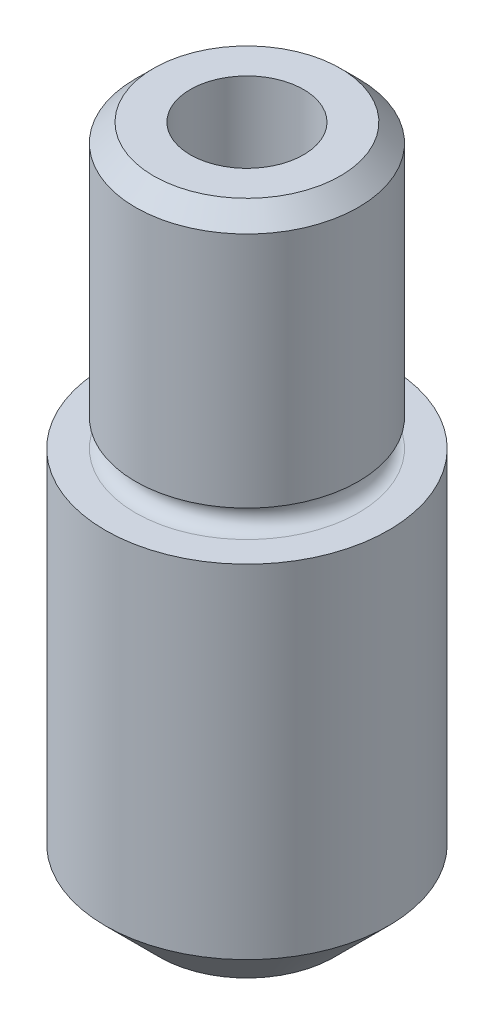
ISO-10303-21;
HEADER;
FILE_DESCRIPTION(('STEP AP214'),'2;1');
FILE_NAME('part.step','',(''),(''),'','','');
FILE_SCHEMA(('AUTOMOTIVE_DESIGN { 1 0 10303 214 1 1 1 1 }'));
ENDSEC;
DATA;
#1=APPLICATION_CONTEXT('core data for automotive mechanical design processes');
#2=APPLICATION_PROTOCOL_DEFINITION('international standard','automotive_design',2000,#1);
#3=PRODUCT_CONTEXT('',#1,'mechanical');
#4=PRODUCT('Part','Part','',(#3));
#5=PRODUCT_RELATED_PRODUCT_CATEGORY('part','',(#4));
#6=PRODUCT_DEFINITION_FORMATION('','',#4);
#7=PRODUCT_DEFINITION_CONTEXT('part definition',#1,'design');
#8=PRODUCT_DEFINITION('design','',#6,#7);
#9=PRODUCT_DEFINITION_SHAPE('','',#8);
#10=(LENGTH_UNIT() NAMED_UNIT(*) SI_UNIT(.MILLI.,.METRE.));
#11=(NAMED_UNIT(*) PLANE_ANGLE_UNIT() SI_UNIT($,.RADIAN.));
#12=(NAMED_UNIT(*) SI_UNIT($,.STERADIAN.) SOLID_ANGLE_UNIT());
#13=UNCERTAINTY_MEASURE_WITH_UNIT(LENGTH_MEASURE(1.E-05),#10,'distance_accuracy_value','');
#14=(GEOMETRIC_REPRESENTATION_CONTEXT(3) GLOBAL_UNCERTAINTY_ASSIGNED_CONTEXT((#13)) GLOBAL_UNIT_ASSIGNED_CONTEXT((#10,
#11,#12)) REPRESENTATION_CONTEXT('',''));
#15=CARTESIAN_POINT('',(0.,0.,0.));
#16=DIRECTION('',(0.,0.,1.));
#17=DIRECTION('',(1.,0.,0.));
#18=AXIS2_PLACEMENT_3D('',#15,#16,#17);
#19=CARTESIAN_POINT('',(0.,9.525,0.));
#20=DIRECTION('',(0.,-1.,0.));
#21=DIRECTION('',(0.,0.,-1.));
#22=AXIS2_PLACEMENT_3D('',#19,#20,#21);
#23=CYLINDRICAL_SURFACE('',#22,1.98501);
#24=CARTESIAN_POINT('',(0.,0.762000000000004,0.));
#25=DIRECTION('',(0.,1.,0.));
#26=DIRECTION('',(0.,0.,1.));
#27=AXIS2_PLACEMENT_3D('',#24,#25,#26);
#28=CIRCLE('',#27,1.98501);
#29=CARTESIAN_POINT('',(0.,0.762000000000004,1.98501));
#30=VERTEX_POINT('',#29);
#31=EDGE_CURVE('E51',#30,#30,#28,.T.);
#32=ORIENTED_EDGE('',*,*,#31,.T.);
#33=EDGE_LOOP('',(#32));
#34=FACE_BOUND('',#33,.T.);
#35=CARTESIAN_POINT('',(0.,5.5626,0.));
#36=DIRECTION('',(0.,1.,0.));
#37=DIRECTION('',(0.,0.,1.));
#38=AXIS2_PLACEMENT_3D('',#35,#36,#37);
#39=CIRCLE('',#38,1.98501);
#40=CARTESIAN_POINT('',(0.,5.5626,1.98501));
#41=VERTEX_POINT('',#40);
#42=EDGE_CURVE('E63',#41,#41,#39,.T.);
#43=ORIENTED_EDGE('',*,*,#42,.F.);
#44=EDGE_LOOP('',(#43));
#45=FACE_BOUND('',#44,.T.);
#46=ADVANCED_FACE('F43',(#34,#45),#23,.T.);
#47=CARTESIAN_POINT('',(0.,0.,0.));
#48=DIRECTION('',(0.,1.,0.));
#49=DIRECTION('',(0.,0.,1.));
#50=AXIS2_PLACEMENT_3D('',#47,#48,#49);
#51=PLANE('',#50);
#52=CARTESIAN_POINT('',(0.,0.,0.));
#53=DIRECTION('',(0.,1.,0.));
#54=DIRECTION('',(0.,0.,1.));
#55=AXIS2_PLACEMENT_3D('',#52,#53,#54);
#56=CIRCLE('',#55,0.793749999999998);
#57=CARTESIAN_POINT('',(0.,0.,0.793749999999998));
#58=VERTEX_POINT('',#57);
#59=EDGE_CURVE('E69',#58,#58,#56,.T.);
#60=ORIENTED_EDGE('',*,*,#59,.T.);
#61=EDGE_LOOP('',(#60));
#62=FACE_BOUND('',#61,.T.);
#63=CARTESIAN_POINT('',(0.,0.,0.));
#64=DIRECTION('',(0.,1.,0.));
#65=DIRECTION('',(0.,0.,1.));
#66=AXIS2_PLACEMENT_3D('',#63,#64,#65);
#67=CIRCLE('',#66,1.22300999999999);
#68=CARTESIAN_POINT('',(0.,0.,1.22300999999999));
#69=VERTEX_POINT('',#68);
#70=EDGE_CURVE('E12',#69,#69,#67,.F.);
#71=ORIENTED_EDGE('',*,*,#70,.T.);
#72=EDGE_LOOP('',(#71));
#73=FACE_BOUND('',#72,.T.);
#74=ADVANCED_FACE('F97',(#62,#73),#51,.F.);
#75=CARTESIAN_POINT('',(0.,5.5626,0.));
#76=DIRECTION('',(0.,1.,0.));
#77=DIRECTION('',(0.,0.,1.));
#78=AXIS2_PLACEMENT_3D('',#75,#76,#77);
#79=PLANE('',#78);
#80=CARTESIAN_POINT('',(0.,5.5626,0.));
#81=DIRECTION('',(0.,1.,0.));
#82=DIRECTION('',(0.,0.,1.));
#83=AXIS2_PLACEMENT_3D('',#80,#81,#82);
#84=CIRCLE('',#83,1.5621);
#85=CARTESIAN_POINT('',(0.,5.5626,1.5621));
#86=VERTEX_POINT('',#85);
#87=EDGE_CURVE('E66',#86,#86,#84,.T.);
#88=ORIENTED_EDGE('',*,*,#87,.F.);
#89=EDGE_LOOP('',(#88));
#90=FACE_BOUND('',#89,.T.);
#91=ORIENTED_EDGE('',*,*,#42,.T.);
#92=EDGE_LOOP('',(#91));
#93=FACE_BOUND('',#92,.T.);
#94=ADVANCED_FACE('F102',(#90,#93),#79,.T.);
#95=CARTESIAN_POINT('',(0.,0.762000000000004,0.));
#96=DIRECTION('',(0.,1.,0.));
#97=DIRECTION('',(0.,0.,1.));
#98=AXIS2_PLACEMENT_3D('',#95,#96,#97);
#99=CONICAL_SURFACE('',#98,1.98501,0.78539816339745);
#100=ORIENTED_EDGE('',*,*,#70,.F.);
#101=EDGE_LOOP('',(#100));
#102=FACE_BOUND('',#101,.T.);
#103=ORIENTED_EDGE('',*,*,#31,.F.);
#104=EDGE_LOOP('',(#103));
#105=FACE_BOUND('',#104,.T.);
#106=ADVANCED_FACE('F45',(#102,#105),#99,.T.);
#107=CARTESIAN_POINT('',(0.,5.7531,0.));
#108=DIRECTION('',(0.,1.,0.));
#109=DIRECTION('',(0.,0.,1.));
#110=AXIS2_PLACEMENT_3D('',#107,#108,#109);
#111=TOROIDAL_SURFACE('',#110,1.5621,0.1905);
#112=CARTESIAN_POINT('',(0.,5.9436,0.));
#113=DIRECTION('',(0.,-1.,0.));
#114=DIRECTION('',(0.,0.,-1.));
#115=AXIS2_PLACEMENT_3D('',#112,#113,#114);
#116=CIRCLE('',#115,1.5621);
#117=CARTESIAN_POINT('',(0.,5.9436,-1.5621));
#118=VERTEX_POINT('',#117);
#119=EDGE_CURVE('E47',#118,#118,#116,.T.);
#120=ORIENTED_EDGE('',*,*,#119,.T.);
#121=EDGE_LOOP('',(#120));
#122=FACE_BOUND('',#121,.T.);
#123=ORIENTED_EDGE('',*,*,#87,.T.);
#124=EDGE_LOOP('',(#123));
#125=FACE_BOUND('',#124,.T.);
#126=ADVANCED_FACE('F82',(#122,#125),#111,.F.);
#127=CARTESIAN_POINT('',(0.,9.525,0.));
#128=DIRECTION('',(0.,1.,0.));
#129=DIRECTION('',(0.,0.,1.));
#130=AXIS2_PLACEMENT_3D('',#127,#128,#129);
#131=PLANE('',#130);
#132=CARTESIAN_POINT('',(0.,9.525,0.));
#133=DIRECTION('',(0.,1.,0.));
#134=DIRECTION('',(0.,0.,1.));
#135=AXIS2_PLACEMENT_3D('',#132,#133,#134);
#136=CIRCLE('',#135,0.793749999999987);
#137=CARTESIAN_POINT('',(0.,9.525,0.793749999999987));
#138=VERTEX_POINT('',#137);
#139=EDGE_CURVE('E72',#138,#138,#136,.T.);
#140=ORIENTED_EDGE('',*,*,#139,.F.);
#141=EDGE_LOOP('',(#140));
#142=FACE_BOUND('',#141,.T.);
#143=CARTESIAN_POINT('',(0.,9.525,0.));
#144=DIRECTION('',(0.,1.,0.));
#145=DIRECTION('',(0.,0.,1.));
#146=AXIS2_PLACEMENT_3D('',#143,#144,#145);
#147=CIRCLE('',#146,1.3081);
#148=CARTESIAN_POINT('',(0.,9.525,1.3081));
#149=VERTEX_POINT('',#148);
#150=EDGE_CURVE('E60',#149,#149,#147,.T.);
#151=ORIENTED_EDGE('',*,*,#150,.T.);
#152=EDGE_LOOP('',(#151));
#153=FACE_BOUND('',#152,.T.);
#154=ADVANCED_FACE('F78',(#142,#153),#131,.T.);
#155=CARTESIAN_POINT('',(0.,9.525,0.));
#156=DIRECTION('',(0.,-1.,0.));
#157=DIRECTION('',(0.,0.,-1.));
#158=AXIS2_PLACEMENT_3D('',#155,#156,#157);
#159=CONICAL_SURFACE('',#158,1.3081,0.785398163397447);
#160=CARTESIAN_POINT('',(0.,9.271,0.));
#161=DIRECTION('',(0.,1.,0.));
#162=DIRECTION('',(0.,0.,1.));
#163=AXIS2_PLACEMENT_3D('',#160,#161,#162);
#164=CIRCLE('',#163,1.5621);
#165=CARTESIAN_POINT('',(0.,9.271,1.5621));
#166=VERTEX_POINT('',#165);
#167=EDGE_CURVE('E55',#166,#166,#164,.F.);
#168=ORIENTED_EDGE('',*,*,#167,.F.);
#169=EDGE_LOOP('',(#168));
#170=FACE_BOUND('',#169,.T.);
#171=ORIENTED_EDGE('',*,*,#150,.F.);
#172=EDGE_LOOP('',(#171));
#173=FACE_BOUND('',#172,.T.);
#174=ADVANCED_FACE('F81',(#170,#173),#159,.T.);
#175=CARTESIAN_POINT('',(0.,5.5626,0.));
#176=DIRECTION('',(0.,1.,0.));
#177=DIRECTION('',(0.,0.,1.));
#178=AXIS2_PLACEMENT_3D('',#175,#176,#177);
#179=CYLINDRICAL_SURFACE('',#178,1.5621);
#180=ORIENTED_EDGE('',*,*,#119,.F.);
#181=EDGE_LOOP('',(#180));
#182=FACE_BOUND('',#181,.T.);
#183=ORIENTED_EDGE('',*,*,#167,.T.);
#184=EDGE_LOOP('',(#183));
#185=FACE_BOUND('',#184,.T.);
#186=ADVANCED_FACE('F87',(#182,#185),#179,.T.);
#187=CARTESIAN_POINT('',(0.,9.525,0.));
#188=DIRECTION('',(0.,1.,0.));
#189=DIRECTION('',(0.,0.,1.));
#190=AXIS2_PLACEMENT_3D('',#187,#188,#189);
#191=CYLINDRICAL_SURFACE('',#190,0.793749999999992);
#192=ORIENTED_EDGE('',*,*,#59,.F.);
#193=EDGE_LOOP('',(#192));
#194=FACE_BOUND('',#193,.T.);
#195=ORIENTED_EDGE('',*,*,#139,.T.);
#196=EDGE_LOOP('',(#195));
#197=FACE_BOUND('',#196,.T.);
#198=ADVANCED_FACE('F76',(#194,#197),#191,.F.);
#199=CLOSED_SHELL('',(#46,#74,#94,#106,#126,#154,#174,#186,#198));
#200=MANIFOLD_SOLID_BREP('B2',#199);
#201=ADVANCED_BREP_SHAPE_REPRESENTATION('',(#18,#200),#14);
#202=SHAPE_DEFINITION_REPRESENTATION(#9,#201);
ENDSEC;
END-ISO-10303-21;
